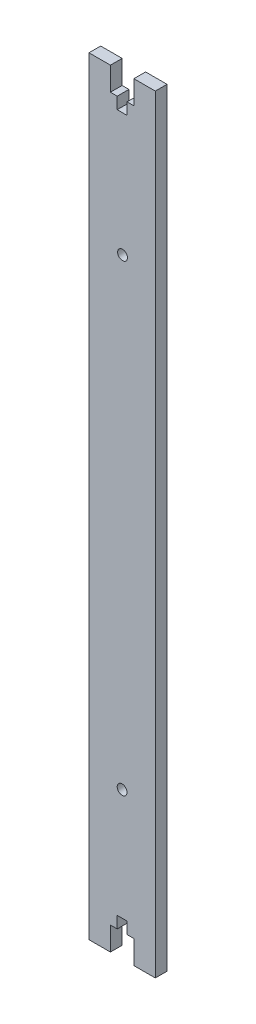
ISO-10303-21;
HEADER;
FILE_DESCRIPTION(('STEP AP214'),'2;1');
FILE_NAME('part.step','',(''),(''),'','','');
FILE_SCHEMA(('AUTOMOTIVE_DESIGN { 1 0 10303 214 1 1 1 1 }'));
ENDSEC;
DATA;
#1=APPLICATION_CONTEXT('core data for automotive mechanical design processes');
#2=APPLICATION_PROTOCOL_DEFINITION('international standard','automotive_design',2000,#1);
#3=PRODUCT_CONTEXT('',#1,'mechanical');
#4=PRODUCT('Part','Part','',(#3));
#5=PRODUCT_RELATED_PRODUCT_CATEGORY('part','',(#4));
#6=PRODUCT_DEFINITION_FORMATION('','',#4);
#7=PRODUCT_DEFINITION_CONTEXT('part definition',#1,'design');
#8=PRODUCT_DEFINITION('design','',#6,#7);
#9=PRODUCT_DEFINITION_SHAPE('','',#8);
#10=(LENGTH_UNIT() NAMED_UNIT(*) SI_UNIT(.MILLI.,.METRE.));
#11=(NAMED_UNIT(*) PLANE_ANGLE_UNIT() SI_UNIT($,.RADIAN.));
#12=(NAMED_UNIT(*) SI_UNIT($,.STERADIAN.) SOLID_ANGLE_UNIT());
#13=UNCERTAINTY_MEASURE_WITH_UNIT(LENGTH_MEASURE(1.E-05),#10,'distance_accuracy_value','');
#14=(GEOMETRIC_REPRESENTATION_CONTEXT(3) GLOBAL_UNCERTAINTY_ASSIGNED_CONTEXT((#13)) GLOBAL_UNIT_ASSIGNED_CONTEXT((#10,
#11,#12)) REPRESENTATION_CONTEXT('',''));
#15=CARTESIAN_POINT('',(0.,0.,0.));
#16=DIRECTION('',(0.,0.,1.));
#17=DIRECTION('',(1.,0.,0.));
#18=AXIS2_PLACEMENT_3D('',#15,#16,#17);
#19=CARTESIAN_POINT('',(-14.14,163.75,5.));
#20=DIRECTION('',(0.,-1.,0.));
#21=DIRECTION('',(0.,0.,-1.));
#22=AXIS2_PLACEMENT_3D('',#19,#20,#21);
#23=PLANE('',#22);
#24=DIRECTION('',(-1.,0.,0.));
#25=VECTOR('',#24,1.);
#26=CARTESIAN_POINT('',(-14.14,163.75,0.));
#27=LINE('',#26,#25);
#28=CARTESIAN_POINT('',(14.14,163.75,0.));
#29=VERTEX_POINT('',#28);
#30=CARTESIAN_POINT('',(5.,163.75,0.));
#31=VERTEX_POINT('',#30);
#32=EDGE_CURVE('E217',#29,#31,#27,.T.);
#33=ORIENTED_EDGE('',*,*,#32,.T.);
#34=DIRECTION('',(0.,0.,1.));
#35=VECTOR('',#34,1.);
#36=CARTESIAN_POINT('',(5.,163.75,-5.));
#37=LINE('',#36,#35);
#38=CARTESIAN_POINT('',(5.,163.75,5.));
#39=VERTEX_POINT('',#38);
#40=EDGE_CURVE('E237',#31,#39,#37,.T.);
#41=ORIENTED_EDGE('',*,*,#40,.T.);
#42=DIRECTION('',(-1.,0.,0.));
#43=VECTOR('',#42,1.);
#44=CARTESIAN_POINT('',(-14.14,163.75,5.));
#45=LINE('',#44,#43);
#46=CARTESIAN_POINT('',(14.14,163.75,5.));
#47=VERTEX_POINT('',#46);
#48=EDGE_CURVE('E196',#47,#39,#45,.T.);
#49=ORIENTED_EDGE('',*,*,#48,.F.);
#50=DIRECTION('',(0.,0.,-1.));
#51=VECTOR('',#50,1.);
#52=CARTESIAN_POINT('',(14.14,163.75,5.));
#53=LINE('',#52,#51);
#54=EDGE_CURVE('E231',#47,#29,#53,.T.);
#55=ORIENTED_EDGE('',*,*,#54,.T.);
#56=EDGE_LOOP('',(#33,#41,#49,#55));
#57=FACE_BOUND('',#56,.T.);
#58=ADVANCED_FACE('F33',(#57),#23,.F.);
#59=CARTESIAN_POINT('',(-14.14,-163.75,5.));
#60=DIRECTION('',(0.,1.,0.));
#61=DIRECTION('',(0.,0.,1.));
#62=AXIS2_PLACEMENT_3D('',#59,#60,#61);
#63=PLANE('',#62);
#64=DIRECTION('',(1.,0.,0.));
#65=VECTOR('',#64,1.);
#66=CARTESIAN_POINT('',(-14.14,-163.75,0.));
#67=LINE('',#66,#65);
#68=CARTESIAN_POINT('',(-14.14,-163.75,0.));
#69=VERTEX_POINT('',#68);
#70=CARTESIAN_POINT('',(-4.99999999999996,-163.75,0.));
#71=VERTEX_POINT('',#70);
#72=EDGE_CURVE('E202',#69,#71,#67,.T.);
#73=ORIENTED_EDGE('',*,*,#72,.T.);
#74=DIRECTION('',(0.,0.,1.));
#75=VECTOR('',#74,1.);
#76=CARTESIAN_POINT('',(-4.99999999999996,-163.75,-5.));
#77=LINE('',#76,#75);
#78=CARTESIAN_POINT('',(-4.99999999999996,-163.75,5.));
#79=VERTEX_POINT('',#78);
#80=EDGE_CURVE('E190',#71,#79,#77,.T.);
#81=ORIENTED_EDGE('',*,*,#80,.T.);
#82=DIRECTION('',(1.,0.,0.));
#83=VECTOR('',#82,1.);
#84=CARTESIAN_POINT('',(-14.14,-163.75,5.));
#85=LINE('',#84,#83);
#86=CARTESIAN_POINT('',(-14.14,-163.75,5.));
#87=VERTEX_POINT('',#86);
#88=EDGE_CURVE('E208',#87,#79,#85,.T.);
#89=ORIENTED_EDGE('',*,*,#88,.F.);
#90=DIRECTION('',(0.,0.,-1.));
#91=VECTOR('',#90,1.);
#92=CARTESIAN_POINT('',(-14.14,-163.75,5.));
#93=LINE('',#92,#91);
#94=EDGE_CURVE('E227',#87,#69,#93,.T.);
#95=ORIENTED_EDGE('',*,*,#94,.T.);
#96=EDGE_LOOP('',(#73,#81,#89,#95));
#97=FACE_BOUND('',#96,.T.);
#98=ADVANCED_FACE('F396',(#97),#63,.F.);
#99=CARTESIAN_POINT('',(14.14,163.75,5.));
#100=DIRECTION('',(-1.,0.,0.));
#101=DIRECTION('',(0.,-1.,0.));
#102=AXIS2_PLACEMENT_3D('',#99,#100,#101);
#103=PLANE('',#102);
#104=DIRECTION('',(0.,1.,0.));
#105=VECTOR('',#104,1.);
#106=CARTESIAN_POINT('',(14.14,163.75,0.));
#107=LINE('',#106,#105);
#108=CARTESIAN_POINT('',(14.14,-163.75,0.));
#109=VERTEX_POINT('',#108);
#110=EDGE_CURVE('E212',#109,#29,#107,.T.);
#111=ORIENTED_EDGE('',*,*,#110,.T.);
#112=ORIENTED_EDGE('',*,*,#54,.F.);
#113=DIRECTION('',(0.,1.,0.));
#114=VECTOR('',#113,1.);
#115=CARTESIAN_POINT('',(14.14,163.75,5.));
#116=LINE('',#115,#114);
#117=CARTESIAN_POINT('',(14.14,-163.75,5.));
#118=VERTEX_POINT('',#117);
#119=EDGE_CURVE('E197',#118,#47,#116,.T.);
#120=ORIENTED_EDGE('',*,*,#119,.F.);
#121=DIRECTION('',(0.,0.,-1.));
#122=VECTOR('',#121,1.);
#123=CARTESIAN_POINT('',(14.14,-163.75,5.));
#124=LINE('',#123,#122);
#125=EDGE_CURVE('E211',#118,#109,#124,.T.);
#126=ORIENTED_EDGE('',*,*,#125,.T.);
#127=EDGE_LOOP('',(#111,#112,#120,#126));
#128=FACE_BOUND('',#127,.T.);
#129=ADVANCED_FACE('F35',(#128),#103,.F.);
#130=CARTESIAN_POINT('',(-5.,163.75,5.));
#131=VERTEX_POINT('',#130);
#132=CARTESIAN_POINT('',(-14.14,163.75,5.));
#133=VERTEX_POINT('',#132);
#134=EDGE_CURVE('E185',#131,#133,#45,.T.);
#135=ORIENTED_EDGE('',*,*,#134,.F.);
#136=DIRECTION('',(0.,0.,1.));
#137=VECTOR('',#136,1.);
#138=CARTESIAN_POINT('',(-5.,163.75,-5.));
#139=LINE('',#138,#137);
#140=CARTESIAN_POINT('',(-5.,163.75,0.));
#141=VERTEX_POINT('',#140);
#142=EDGE_CURVE('E169',#141,#131,#139,.T.);
#143=ORIENTED_EDGE('',*,*,#142,.F.);
#144=CARTESIAN_POINT('',(-14.14,163.75,0.));
#145=VERTEX_POINT('',#144);
#146=EDGE_CURVE('E215',#141,#145,#27,.T.);
#147=ORIENTED_EDGE('',*,*,#146,.T.);
#148=DIRECTION('',(0.,0.,-1.));
#149=VECTOR('',#148,1.);
#150=CARTESIAN_POINT('',(-14.14,163.75,5.));
#151=LINE('',#150,#149);
#152=EDGE_CURVE('E194',#133,#145,#151,.T.);
#153=ORIENTED_EDGE('',*,*,#152,.F.);
#154=EDGE_LOOP('',(#135,#143,#147,#153));
#155=FACE_BOUND('',#154,.T.);
#156=ADVANCED_FACE('F192',(#155),#23,.F.);
#157=CARTESIAN_POINT('',(-14.14,163.75,5.));
#158=DIRECTION('',(1.,0.,0.));
#159=DIRECTION('',(0.,1.,0.));
#160=AXIS2_PLACEMENT_3D('',#157,#158,#159);
#161=PLANE('',#160);
#162=DIRECTION('',(0.,-1.,0.));
#163=VECTOR('',#162,1.);
#164=CARTESIAN_POINT('',(-14.14,163.75,0.));
#165=LINE('',#164,#163);
#166=EDGE_CURVE('E220',#145,#69,#165,.T.);
#167=ORIENTED_EDGE('',*,*,#166,.T.);
#168=ORIENTED_EDGE('',*,*,#94,.F.);
#169=DIRECTION('',(0.,-1.,0.));
#170=VECTOR('',#169,1.);
#171=CARTESIAN_POINT('',(-14.14,163.75,5.));
#172=LINE('',#171,#170);
#173=EDGE_CURVE('E200',#133,#87,#172,.T.);
#174=ORIENTED_EDGE('',*,*,#173,.F.);
#175=ORIENTED_EDGE('',*,*,#152,.T.);
#176=EDGE_LOOP('',(#167,#168,#174,#175));
#177=FACE_BOUND('',#176,.T.);
#178=ADVANCED_FACE('F399',(#177),#161,.F.);
#179=CARTESIAN_POINT('',(5.00000000000004,-163.75,5.));
#180=VERTEX_POINT('',#179);
#181=EDGE_CURVE('E207',#180,#118,#85,.T.);
#182=ORIENTED_EDGE('',*,*,#181,.F.);
#183=DIRECTION('',(0.,0.,1.));
#184=VECTOR('',#183,1.);
#185=CARTESIAN_POINT('',(5.00000000000004,-163.75,-5.));
#186=LINE('',#185,#184);
#187=CARTESIAN_POINT('',(5.00000000000004,-163.75,0.));
#188=VERTEX_POINT('',#187);
#189=EDGE_CURVE('E319',#188,#180,#186,.T.);
#190=ORIENTED_EDGE('',*,*,#189,.F.);
#191=EDGE_CURVE('E222',#188,#109,#67,.T.);
#192=ORIENTED_EDGE('',*,*,#191,.T.);
#193=ORIENTED_EDGE('',*,*,#125,.F.);
#194=EDGE_LOOP('',(#182,#190,#192,#193));
#195=FACE_BOUND('',#194,.T.);
#196=ADVANCED_FACE('F368',(#195),#63,.F.);
#197=CARTESIAN_POINT('',(0.,0.,5.));
#198=DIRECTION('',(0.,0.,1.));
#199=DIRECTION('',(1.,0.,0.));
#200=AXIS2_PLACEMENT_3D('',#197,#198,#199);
#201=PLANE('',#200);
#202=CARTESIAN_POINT('',(-0.0021356237309457,-101.25,5.));
#203=DIRECTION('',(0.,0.,1.));
#204=DIRECTION('',(1.,0.,0.));
#205=AXIS2_PLACEMENT_3D('',#202,#203,#204);
#206=CIRCLE('',#205,2.1);
#207=CARTESIAN_POINT('',(2.09786437626906,-101.25,5.));
#208=VERTEX_POINT('',#207);
#209=EDGE_CURVE('E337',#208,#208,#206,.T.);
#210=ORIENTED_EDGE('',*,*,#209,.F.);
#211=EDGE_LOOP('',(#210));
#212=FACE_BOUND('',#211,.T.);
#213=DIRECTION('',(0.,1.,0.));
#214=VECTOR('',#213,1.);
#215=CARTESIAN_POINT('',(5.,163.75,5.));
#216=LINE('',#215,#214);
#217=CARTESIAN_POINT('',(5.,153.75,5.));
#218=VERTEX_POINT('',#217);
#219=EDGE_CURVE('E179',#218,#39,#216,.T.);
#220=ORIENTED_EDGE('',*,*,#219,.F.);
#221=DIRECTION('',(1.,0.,0.));
#222=VECTOR('',#221,1.);
#223=CARTESIAN_POINT('',(5.,153.75,5.));
#224=LINE('',#223,#222);
#225=CARTESIAN_POINT('',(2.1,153.75,5.));
#226=VERTEX_POINT('',#225);
#227=EDGE_CURVE('E353',#226,#218,#224,.T.);
#228=ORIENTED_EDGE('',*,*,#227,.F.);
#229=DIRECTION('',(0.,1.,0.));
#230=VECTOR('',#229,1.);
#231=CARTESIAN_POINT('',(2.1,153.75,5.));
#232=LINE('',#231,#230);
#233=CARTESIAN_POINT('',(2.1,148.75,5.));
#234=VERTEX_POINT('',#233);
#235=EDGE_CURVE('E286',#234,#226,#232,.T.);
#236=ORIENTED_EDGE('',*,*,#235,.F.);
#237=DIRECTION('',(1.,0.,0.));
#238=VECTOR('',#237,1.);
#239=CARTESIAN_POINT('',(2.1,148.75,5.));
#240=LINE('',#239,#238);
#241=CARTESIAN_POINT('',(-2.1,148.75,5.));
#242=VERTEX_POINT('',#241);
#243=EDGE_CURVE('E349',#242,#234,#240,.T.);
#244=ORIENTED_EDGE('',*,*,#243,.F.);
#245=DIRECTION('',(0.,-1.,0.));
#246=VECTOR('',#245,1.);
#247=CARTESIAN_POINT('',(-2.1,153.75,5.));
#248=LINE('',#247,#246);
#249=CARTESIAN_POINT('',(-2.1,153.75,5.));
#250=VERTEX_POINT('',#249);
#251=EDGE_CURVE('E346',#250,#242,#248,.T.);
#252=ORIENTED_EDGE('',*,*,#251,.F.);
#253=DIRECTION('',(1.,0.,0.));
#254=VECTOR('',#253,1.);
#255=CARTESIAN_POINT('',(-5.,153.75,5.));
#256=LINE('',#255,#254);
#257=CARTESIAN_POINT('',(-5.,153.75,5.));
#258=VERTEX_POINT('',#257);
#259=EDGE_CURVE('E189',#258,#250,#256,.T.);
#260=ORIENTED_EDGE('',*,*,#259,.F.);
#261=DIRECTION('',(0.,-1.,0.));
#262=VECTOR('',#261,1.);
#263=CARTESIAN_POINT('',(-5.,163.75,5.));
#264=LINE('',#263,#262);
#265=EDGE_CURVE('E172',#131,#258,#264,.T.);
#266=ORIENTED_EDGE('',*,*,#265,.F.);
#267=ORIENTED_EDGE('',*,*,#134,.T.);
#268=ORIENTED_EDGE('',*,*,#173,.T.);
#269=ORIENTED_EDGE('',*,*,#88,.T.);
#270=DIRECTION('',(0.,-1.,0.));
#271=VECTOR('',#270,1.);
#272=CARTESIAN_POINT('',(-4.99999999999996,-163.75,5.));
#273=LINE('',#272,#271);
#274=CARTESIAN_POINT('',(-4.99999999999996,-153.75,5.));
#275=VERTEX_POINT('',#274);
#276=EDGE_CURVE('E317',#275,#79,#273,.T.);
#277=ORIENTED_EDGE('',*,*,#276,.F.);
#278=DIRECTION('',(-1.,0.,0.));
#279=VECTOR('',#278,1.);
#280=CARTESIAN_POINT('',(-4.99999999999996,-153.75,5.));
#281=LINE('',#280,#279);
#282=CARTESIAN_POINT('',(-2.09999999999996,-153.75,5.));
#283=VERTEX_POINT('',#282);
#284=EDGE_CURVE('E314',#283,#275,#281,.T.);
#285=ORIENTED_EDGE('',*,*,#284,.F.);
#286=DIRECTION('',(0.,-1.,0.));
#287=VECTOR('',#286,1.);
#288=CARTESIAN_POINT('',(-2.09999999999996,-153.75,5.));
#289=LINE('',#288,#287);
#290=CARTESIAN_POINT('',(-2.09999999999996,-148.75,5.));
#291=VERTEX_POINT('',#290);
#292=EDGE_CURVE('E311',#291,#283,#289,.T.);
#293=ORIENTED_EDGE('',*,*,#292,.F.);
#294=DIRECTION('',(-1.,0.,0.));
#295=VECTOR('',#294,1.);
#296=CARTESIAN_POINT('',(2.10000000000004,-148.75,5.));
#297=LINE('',#296,#295);
#298=CARTESIAN_POINT('',(2.10000000000004,-148.75,5.));
#299=VERTEX_POINT('',#298);
#300=EDGE_CURVE('E308',#299,#291,#297,.T.);
#301=ORIENTED_EDGE('',*,*,#300,.F.);
#302=DIRECTION('',(0.,1.,0.));
#303=VECTOR('',#302,1.);
#304=CARTESIAN_POINT('',(2.10000000000004,-153.75,5.));
#305=LINE('',#304,#303);
#306=CARTESIAN_POINT('',(2.10000000000004,-153.75,5.));
#307=VERTEX_POINT('',#306);
#308=EDGE_CURVE('E305',#307,#299,#305,.T.);
#309=ORIENTED_EDGE('',*,*,#308,.F.);
#310=DIRECTION('',(-1.,0.,0.));
#311=VECTOR('',#310,1.);
#312=CARTESIAN_POINT('',(5.00000000000004,-153.75,5.));
#313=LINE('',#312,#311);
#314=CARTESIAN_POINT('',(5.00000000000004,-153.75,5.));
#315=VERTEX_POINT('',#314);
#316=EDGE_CURVE('E301',#315,#307,#313,.T.);
#317=ORIENTED_EDGE('',*,*,#316,.F.);
#318=DIRECTION('',(0.,1.,0.));
#319=VECTOR('',#318,1.);
#320=CARTESIAN_POINT('',(5.00000000000004,-163.75,5.));
#321=LINE('',#320,#319);
#322=EDGE_CURVE('E299',#180,#315,#321,.T.);
#323=ORIENTED_EDGE('',*,*,#322,.F.);
#324=ORIENTED_EDGE('',*,*,#181,.T.);
#325=ORIENTED_EDGE('',*,*,#119,.T.);
#326=ORIENTED_EDGE('',*,*,#48,.T.);
#327=EDGE_LOOP('',(#220,#228,#236,#244,#252,#260,#266,#267,#268,#269,#277,#285,#293,#301,#309,
#317,#323,#324,#325,#326));
#328=FACE_BOUND('',#327,.T.);
#329=CARTESIAN_POINT('',(0.163980899785712,96.2499999999999,5.));
#330=DIRECTION('',(0.,0.,1.));
#331=DIRECTION('',(1.,0.,0.));
#332=AXIS2_PLACEMENT_3D('',#329,#330,#331);
#333=CIRCLE('',#332,2.1);
#334=CARTESIAN_POINT('',(2.26398089978572,96.2499999999999,5.));
#335=VERTEX_POINT('',#334);
#336=EDGE_CURVE('E302',#335,#335,#333,.T.);
#337=ORIENTED_EDGE('',*,*,#336,.F.);
#338=EDGE_LOOP('',(#337));
#339=FACE_BOUND('',#338,.T.);
#340=ADVANCED_FACE('F183',(#212,#328,#339),#201,.T.);
#341=CARTESIAN_POINT('',(0.,0.,0.));
#342=DIRECTION('',(0.,0.,1.));
#343=DIRECTION('',(1.,0.,0.));
#344=AXIS2_PLACEMENT_3D('',#341,#342,#343);
#345=PLANE('',#344);
#346=CARTESIAN_POINT('',(-0.0021356237309457,-101.25,0.));
#347=DIRECTION('',(0.,0.,1.));
#348=DIRECTION('',(1.,0.,0.));
#349=AXIS2_PLACEMENT_3D('',#346,#347,#348);
#350=CIRCLE('',#349,2.1);
#351=CARTESIAN_POINT('',(2.09786437626906,-101.25,0.));
#352=VERTEX_POINT('',#351);
#353=EDGE_CURVE('E37',#352,#352,#350,.T.);
#354=ORIENTED_EDGE('',*,*,#353,.T.);
#355=EDGE_LOOP('',(#354));
#356=FACE_BOUND('',#355,.T.);
#357=CARTESIAN_POINT('',(0.163980899785712,96.2499999999999,0.));
#358=DIRECTION('',(0.,0.,1.));
#359=DIRECTION('',(1.,0.,0.));
#360=AXIS2_PLACEMENT_3D('',#357,#358,#359);
#361=CIRCLE('',#360,2.1);
#362=CARTESIAN_POINT('',(2.26398089978572,96.2499999999999,0.));
#363=VERTEX_POINT('',#362);
#364=EDGE_CURVE('E216',#363,#363,#361,.T.);
#365=ORIENTED_EDGE('',*,*,#364,.T.);
#366=EDGE_LOOP('',(#365));
#367=FACE_BOUND('',#366,.T.);
#368=DIRECTION('',(1.,0.,0.));
#369=VECTOR('',#368,1.);
#370=CARTESIAN_POINT('',(0.,153.75,0.));
#371=LINE('',#370,#369);
#372=CARTESIAN_POINT('',(2.1,153.75,0.));
#373=VERTEX_POINT('',#372);
#374=CARTESIAN_POINT('',(5.,153.75,0.));
#375=VERTEX_POINT('',#374);
#376=EDGE_CURVE('E42',#373,#375,#371,.T.);
#377=ORIENTED_EDGE('',*,*,#376,.T.);
#378=DIRECTION('',(0.,1.,0.));
#379=VECTOR('',#378,1.);
#380=CARTESIAN_POINT('',(5.00000000000003,0.,0.));
#381=LINE('',#380,#379);
#382=EDGE_CURVE('E11',#375,#31,#381,.T.);
#383=ORIENTED_EDGE('',*,*,#382,.T.);
#384=ORIENTED_EDGE('',*,*,#32,.F.);
#385=ORIENTED_EDGE('',*,*,#110,.F.);
#386=ORIENTED_EDGE('',*,*,#191,.F.);
#387=DIRECTION('',(0.,1.,0.));
#388=VECTOR('',#387,1.);
#389=CARTESIAN_POINT('',(5.,0.,0.));
#390=LINE('',#389,#388);
#391=CARTESIAN_POINT('',(5.00000000000004,-153.75,0.));
#392=VERTEX_POINT('',#391);
#393=EDGE_CURVE('E234',#188,#392,#390,.T.);
#394=ORIENTED_EDGE('',*,*,#393,.T.);
#395=DIRECTION('',(-1.,0.,0.));
#396=VECTOR('',#395,1.);
#397=CARTESIAN_POINT('',(0.,-153.75,0.));
#398=LINE('',#397,#396);
#399=CARTESIAN_POINT('',(2.10000000000004,-153.75,0.));
#400=VERTEX_POINT('',#399);
#401=EDGE_CURVE('E240',#392,#400,#398,.T.);
#402=ORIENTED_EDGE('',*,*,#401,.T.);
#403=DIRECTION('',(0.,1.,0.));
#404=VECTOR('',#403,1.);
#405=CARTESIAN_POINT('',(2.10000000000004,0.,0.));
#406=LINE('',#405,#404);
#407=CARTESIAN_POINT('',(2.10000000000004,-148.75,0.));
#408=VERTEX_POINT('',#407);
#409=EDGE_CURVE('E243',#400,#408,#406,.T.);
#410=ORIENTED_EDGE('',*,*,#409,.T.);
#411=DIRECTION('',(-1.,0.,0.));
#412=VECTOR('',#411,1.);
#413=CARTESIAN_POINT('',(0.,-148.75,0.));
#414=LINE('',#413,#412);
#415=CARTESIAN_POINT('',(-2.09999999999996,-148.75,0.));
#416=VERTEX_POINT('',#415);
#417=EDGE_CURVE('E246',#408,#416,#414,.T.);
#418=ORIENTED_EDGE('',*,*,#417,.T.);
#419=DIRECTION('',(0.,-1.,0.));
#420=VECTOR('',#419,1.);
#421=CARTESIAN_POINT('',(-2.09999999999999,0.,0.));
#422=LINE('',#421,#420);
#423=CARTESIAN_POINT('',(-2.09999999999996,-153.75,0.));
#424=VERTEX_POINT('',#423);
#425=EDGE_CURVE('E249',#416,#424,#422,.T.);
#426=ORIENTED_EDGE('',*,*,#425,.T.);
#427=DIRECTION('',(-1.,0.,0.));
#428=VECTOR('',#427,1.);
#429=CARTESIAN_POINT('',(0.,-153.75,0.));
#430=LINE('',#429,#428);
#431=CARTESIAN_POINT('',(-4.99999999999996,-153.75,0.));
#432=VERTEX_POINT('',#431);
#433=EDGE_CURVE('E252',#424,#432,#430,.T.);
#434=ORIENTED_EDGE('',*,*,#433,.T.);
#435=DIRECTION('',(0.,-1.,0.));
#436=VECTOR('',#435,1.);
#437=CARTESIAN_POINT('',(-4.99999999999997,0.,0.));
#438=LINE('',#437,#436);
#439=EDGE_CURVE('E255',#432,#71,#438,.T.);
#440=ORIENTED_EDGE('',*,*,#439,.T.);
#441=ORIENTED_EDGE('',*,*,#72,.F.);
#442=ORIENTED_EDGE('',*,*,#166,.F.);
#443=ORIENTED_EDGE('',*,*,#146,.F.);
#444=DIRECTION('',(0.,-1.,0.));
#445=VECTOR('',#444,1.);
#446=CARTESIAN_POINT('',(-4.99999999999997,0.,0.));
#447=LINE('',#446,#445);
#448=CARTESIAN_POINT('',(-5.,153.75,0.));
#449=VERTEX_POINT('',#448);
#450=EDGE_CURVE('E175',#141,#449,#447,.T.);
#451=ORIENTED_EDGE('',*,*,#450,.T.);
#452=DIRECTION('',(1.,0.,0.));
#453=VECTOR('',#452,1.);
#454=CARTESIAN_POINT('',(0.,153.75,0.));
#455=LINE('',#454,#453);
#456=CARTESIAN_POINT('',(-2.1,153.75,0.));
#457=VERTEX_POINT('',#456);
#458=EDGE_CURVE('E259',#449,#457,#455,.T.);
#459=ORIENTED_EDGE('',*,*,#458,.T.);
#460=DIRECTION('',(0.,-1.,0.));
#461=VECTOR('',#460,1.);
#462=CARTESIAN_POINT('',(-2.09999999999998,0.,0.));
#463=LINE('',#462,#461);
#464=CARTESIAN_POINT('',(-2.1,148.75,0.));
#465=VERTEX_POINT('',#464);
#466=EDGE_CURVE('E262',#457,#465,#463,.T.);
#467=ORIENTED_EDGE('',*,*,#466,.T.);
#468=DIRECTION('',(1.,0.,0.));
#469=VECTOR('',#468,1.);
#470=CARTESIAN_POINT('',(0.,148.75,0.));
#471=LINE('',#470,#469);
#472=CARTESIAN_POINT('',(2.1,148.75,0.));
#473=VERTEX_POINT('',#472);
#474=EDGE_CURVE('E265',#465,#473,#471,.T.);
#475=ORIENTED_EDGE('',*,*,#474,.T.);
#476=DIRECTION('',(0.,1.,0.));
#477=VECTOR('',#476,1.);
#478=CARTESIAN_POINT('',(2.10000000000002,0.,0.));
#479=LINE('',#478,#477);
#480=EDGE_CURVE('E268',#473,#373,#479,.T.);
#481=ORIENTED_EDGE('',*,*,#480,.T.);
#482=EDGE_LOOP('',(#377,#383,#384,#385,#386,#394,#402,#410,#418,#426,#434,#440,#441,#442,#443,
#451,#459,#467,#475,#481));
#483=FACE_BOUND('',#482,.T.);
#484=ADVANCED_FACE('F273',(#356,#367,#483),#345,.F.);
#485=CARTESIAN_POINT('',(0.163980899785712,96.2499999999999,-5.));
#486=DIRECTION('',(0.,0.,1.));
#487=DIRECTION('',(1.,0.,0.));
#488=AXIS2_PLACEMENT_3D('',#485,#486,#487);
#489=CYLINDRICAL_SURFACE('',#488,2.1);
#490=ORIENTED_EDGE('',*,*,#336,.T.);
#491=EDGE_LOOP('',(#490));
#492=FACE_BOUND('',#491,.T.);
#493=ORIENTED_EDGE('',*,*,#364,.F.);
#494=EDGE_LOOP('',(#493));
#495=FACE_BOUND('',#494,.T.);
#496=ADVANCED_FACE('F458',(#492,#495),#489,.F.);
#497=CARTESIAN_POINT('',(-4.99999999999996,-163.75,-5.));
#498=DIRECTION('',(-1.,0.,0.));
#499=DIRECTION('',(0.,-1.,0.));
#500=AXIS2_PLACEMENT_3D('',#497,#498,#499);
#501=PLANE('',#500);
#502=DIRECTION('',(0.,0.,1.));
#503=VECTOR('',#502,1.);
#504=CARTESIAN_POINT('',(-4.99999999999996,-153.75,-5.));
#505=LINE('',#504,#503);
#506=EDGE_CURVE('E322',#432,#275,#505,.T.);
#507=ORIENTED_EDGE('',*,*,#506,.T.);
#508=ORIENTED_EDGE('',*,*,#276,.T.);
#509=ORIENTED_EDGE('',*,*,#80,.F.);
#510=ORIENTED_EDGE('',*,*,#439,.F.);
#511=EDGE_LOOP('',(#507,#508,#509,#510));
#512=FACE_BOUND('',#511,.T.);
#513=ADVANCED_FACE('F393',(#512),#501,.F.);
#514=CARTESIAN_POINT('',(-4.99999999999996,-153.75,-5.));
#515=DIRECTION('',(0.,1.,0.));
#516=DIRECTION('',(0.,0.,1.));
#517=AXIS2_PLACEMENT_3D('',#514,#515,#516);
#518=PLANE('',#517);
#519=DIRECTION('',(0.,0.,1.));
#520=VECTOR('',#519,1.);
#521=CARTESIAN_POINT('',(-2.09999999999996,-153.75,-5.));
#522=LINE('',#521,#520);
#523=EDGE_CURVE('E324',#424,#283,#522,.T.);
#524=ORIENTED_EDGE('',*,*,#523,.T.);
#525=ORIENTED_EDGE('',*,*,#284,.T.);
#526=ORIENTED_EDGE('',*,*,#506,.F.);
#527=ORIENTED_EDGE('',*,*,#433,.F.);
#528=EDGE_LOOP('',(#524,#525,#526,#527));
#529=FACE_BOUND('',#528,.T.);
#530=ADVANCED_FACE('F390',(#529),#518,.F.);
#531=CARTESIAN_POINT('',(-2.09999999999996,-153.75,-5.));
#532=DIRECTION('',(-1.,0.,0.));
#533=DIRECTION('',(0.,-1.,0.));
#534=AXIS2_PLACEMENT_3D('',#531,#532,#533);
#535=PLANE('',#534);
#536=DIRECTION('',(0.,0.,1.));
#537=VECTOR('',#536,1.);
#538=CARTESIAN_POINT('',(-2.09999999999996,-148.75,-5.));
#539=LINE('',#538,#537);
#540=EDGE_CURVE('E326',#416,#291,#539,.T.);
#541=ORIENTED_EDGE('',*,*,#540,.T.);
#542=ORIENTED_EDGE('',*,*,#292,.T.);
#543=ORIENTED_EDGE('',*,*,#523,.F.);
#544=ORIENTED_EDGE('',*,*,#425,.F.);
#545=EDGE_LOOP('',(#541,#542,#543,#544));
#546=FACE_BOUND('',#545,.T.);
#547=ADVANCED_FACE('F384',(#546),#535,.F.);
#548=CARTESIAN_POINT('',(2.10000000000004,-148.75,-5.));
#549=DIRECTION('',(0.,1.,0.));
#550=DIRECTION('',(0.,0.,1.));
#551=AXIS2_PLACEMENT_3D('',#548,#549,#550);
#552=PLANE('',#551);
#553=DIRECTION('',(0.,0.,1.));
#554=VECTOR('',#553,1.);
#555=CARTESIAN_POINT('',(2.10000000000004,-148.75,-5.));
#556=LINE('',#555,#554);
#557=EDGE_CURVE('E328',#408,#299,#556,.T.);
#558=ORIENTED_EDGE('',*,*,#557,.T.);
#559=ORIENTED_EDGE('',*,*,#300,.T.);
#560=ORIENTED_EDGE('',*,*,#540,.F.);
#561=ORIENTED_EDGE('',*,*,#417,.F.);
#562=EDGE_LOOP('',(#558,#559,#560,#561));
#563=FACE_BOUND('',#562,.T.);
#564=ADVANCED_FACE('F380',(#563),#552,.F.);
#565=CARTESIAN_POINT('',(2.10000000000004,-153.75,-5.));
#566=DIRECTION('',(1.,0.,0.));
#567=DIRECTION('',(0.,0.,-1.));
#568=AXIS2_PLACEMENT_3D('',#565,#566,#567);
#569=PLANE('',#568);
#570=DIRECTION('',(0.,0.,1.));
#571=VECTOR('',#570,1.);
#572=CARTESIAN_POINT('',(2.10000000000004,-153.75,-5.));
#573=LINE('',#572,#571);
#574=EDGE_CURVE('E330',#400,#307,#573,.T.);
#575=ORIENTED_EDGE('',*,*,#574,.T.);
#576=ORIENTED_EDGE('',*,*,#308,.T.);
#577=ORIENTED_EDGE('',*,*,#557,.F.);
#578=ORIENTED_EDGE('',*,*,#409,.F.);
#579=EDGE_LOOP('',(#575,#576,#577,#578));
#580=FACE_BOUND('',#579,.T.);
#581=ADVANCED_FACE('F378',(#580),#569,.F.);
#582=CARTESIAN_POINT('',(5.00000000000004,-153.75,-5.));
#583=DIRECTION('',(0.,1.,0.));
#584=DIRECTION('',(0.,0.,1.));
#585=AXIS2_PLACEMENT_3D('',#582,#583,#584);
#586=PLANE('',#585);
#587=DIRECTION('',(0.,0.,1.));
#588=VECTOR('',#587,1.);
#589=CARTESIAN_POINT('',(5.00000000000004,-153.75,-5.));
#590=LINE('',#589,#588);
#591=EDGE_CURVE('E57',#392,#315,#590,.T.);
#592=ORIENTED_EDGE('',*,*,#591,.T.);
#593=ORIENTED_EDGE('',*,*,#316,.T.);
#594=ORIENTED_EDGE('',*,*,#574,.F.);
#595=ORIENTED_EDGE('',*,*,#401,.F.);
#596=EDGE_LOOP('',(#592,#593,#594,#595));
#597=FACE_BOUND('',#596,.T.);
#598=ADVANCED_FACE('F375',(#597),#586,.F.);
#599=CARTESIAN_POINT('',(5.00000000000004,-163.75,-5.));
#600=DIRECTION('',(1.,0.,0.));
#601=DIRECTION('',(0.,1.,0.));
#602=AXIS2_PLACEMENT_3D('',#599,#600,#601);
#603=PLANE('',#602);
#604=ORIENTED_EDGE('',*,*,#189,.T.);
#605=ORIENTED_EDGE('',*,*,#322,.T.);
#606=ORIENTED_EDGE('',*,*,#591,.F.);
#607=ORIENTED_EDGE('',*,*,#393,.F.);
#608=EDGE_LOOP('',(#604,#605,#606,#607));
#609=FACE_BOUND('',#608,.T.);
#610=ADVANCED_FACE('F369',(#609),#603,.F.);
#611=CARTESIAN_POINT('',(5.,163.75,-5.));
#612=DIRECTION('',(1.,0.,0.));
#613=DIRECTION('',(0.,1.,0.));
#614=AXIS2_PLACEMENT_3D('',#611,#612,#613);
#615=PLANE('',#614);
#616=DIRECTION('',(0.,0.,1.));
#617=VECTOR('',#616,1.);
#618=CARTESIAN_POINT('',(5.,153.75,-5.));
#619=LINE('',#618,#617);
#620=EDGE_CURVE('E281',#375,#218,#619,.T.);
#621=ORIENTED_EDGE('',*,*,#620,.T.);
#622=ORIENTED_EDGE('',*,*,#219,.T.);
#623=ORIENTED_EDGE('',*,*,#40,.F.);
#624=ORIENTED_EDGE('',*,*,#382,.F.);
#625=EDGE_LOOP('',(#621,#622,#623,#624));
#626=FACE_BOUND('',#625,.T.);
#627=ADVANCED_FACE('F520',(#626),#615,.F.);
#628=CARTESIAN_POINT('',(5.,153.75,-5.));
#629=DIRECTION('',(0.,-1.,0.));
#630=DIRECTION('',(0.,0.,-1.));
#631=AXIS2_PLACEMENT_3D('',#628,#629,#630);
#632=PLANE('',#631);
#633=DIRECTION('',(0.,0.,1.));
#634=VECTOR('',#633,1.);
#635=CARTESIAN_POINT('',(2.1,153.75,-5.));
#636=LINE('',#635,#634);
#637=EDGE_CURVE('E279',#373,#226,#636,.T.);
#638=ORIENTED_EDGE('',*,*,#637,.T.);
#639=ORIENTED_EDGE('',*,*,#227,.T.);
#640=ORIENTED_EDGE('',*,*,#620,.F.);
#641=ORIENTED_EDGE('',*,*,#376,.F.);
#642=EDGE_LOOP('',(#638,#639,#640,#641));
#643=FACE_BOUND('',#642,.T.);
#644=ADVANCED_FACE('F277',(#643),#632,.F.);
#645=CARTESIAN_POINT('',(2.1,153.75,-5.));
#646=DIRECTION('',(1.,0.,0.));
#647=DIRECTION('',(0.,1.,0.));
#648=AXIS2_PLACEMENT_3D('',#645,#646,#647);
#649=PLANE('',#648);
#650=DIRECTION('',(0.,0.,1.));
#651=VECTOR('',#650,1.);
#652=CARTESIAN_POINT('',(2.1,148.75,-5.));
#653=LINE('',#652,#651);
#654=EDGE_CURVE('E288',#473,#234,#653,.T.);
#655=ORIENTED_EDGE('',*,*,#654,.T.);
#656=ORIENTED_EDGE('',*,*,#235,.T.);
#657=ORIENTED_EDGE('',*,*,#637,.F.);
#658=ORIENTED_EDGE('',*,*,#480,.F.);
#659=EDGE_LOOP('',(#655,#656,#657,#658));
#660=FACE_BOUND('',#659,.T.);
#661=ADVANCED_FACE('F283',(#660),#649,.F.);
#662=CARTESIAN_POINT('',(2.1,148.75,-5.));
#663=DIRECTION('',(0.,-1.,0.));
#664=DIRECTION('',(0.,0.,-1.));
#665=AXIS2_PLACEMENT_3D('',#662,#663,#664);
#666=PLANE('',#665);
#667=DIRECTION('',(0.,0.,1.));
#668=VECTOR('',#667,1.);
#669=CARTESIAN_POINT('',(-2.1,148.75,-5.));
#670=LINE('',#669,#668);
#671=EDGE_CURVE('E291',#465,#242,#670,.T.);
#672=ORIENTED_EDGE('',*,*,#671,.T.);
#673=ORIENTED_EDGE('',*,*,#243,.T.);
#674=ORIENTED_EDGE('',*,*,#654,.F.);
#675=ORIENTED_EDGE('',*,*,#474,.F.);
#676=EDGE_LOOP('',(#672,#673,#674,#675));
#677=FACE_BOUND('',#676,.T.);
#678=ADVANCED_FACE('F409',(#677),#666,.F.);
#679=CARTESIAN_POINT('',(-2.1,153.75,-5.));
#680=DIRECTION('',(-1.,0.,0.));
#681=DIRECTION('',(0.,-1.,0.));
#682=AXIS2_PLACEMENT_3D('',#679,#680,#681);
#683=PLANE('',#682);
#684=DIRECTION('',(0.,0.,1.));
#685=VECTOR('',#684,1.);
#686=CARTESIAN_POINT('',(-2.1,153.75,-5.));
#687=LINE('',#686,#685);
#688=EDGE_CURVE('E296',#457,#250,#687,.T.);
#689=ORIENTED_EDGE('',*,*,#688,.T.);
#690=ORIENTED_EDGE('',*,*,#251,.T.);
#691=ORIENTED_EDGE('',*,*,#671,.F.);
#692=ORIENTED_EDGE('',*,*,#466,.F.);
#693=EDGE_LOOP('',(#689,#690,#691,#692));
#694=FACE_BOUND('',#693,.T.);
#695=ADVANCED_FACE('F405',(#694),#683,.F.);
#696=CARTESIAN_POINT('',(-5.,153.75,-5.));
#697=DIRECTION('',(0.,-1.,0.));
#698=DIRECTION('',(0.,0.,-1.));
#699=AXIS2_PLACEMENT_3D('',#696,#697,#698);
#700=PLANE('',#699);
#701=DIRECTION('',(0.,0.,1.));
#702=VECTOR('',#701,1.);
#703=CARTESIAN_POINT('',(-5.,153.75,-5.));
#704=LINE('',#703,#702);
#705=EDGE_CURVE('E49',#449,#258,#704,.T.);
#706=ORIENTED_EDGE('',*,*,#705,.T.);
#707=ORIENTED_EDGE('',*,*,#259,.T.);
#708=ORIENTED_EDGE('',*,*,#688,.F.);
#709=ORIENTED_EDGE('',*,*,#458,.F.);
#710=EDGE_LOOP('',(#706,#707,#708,#709));
#711=FACE_BOUND('',#710,.T.);
#712=ADVANCED_FACE('F403',(#711),#700,.F.);
#713=CARTESIAN_POINT('',(-5.,163.75,-5.));
#714=DIRECTION('',(-1.,0.,0.));
#715=DIRECTION('',(0.,-1.,0.));
#716=AXIS2_PLACEMENT_3D('',#713,#714,#715);
#717=PLANE('',#716);
#718=ORIENTED_EDGE('',*,*,#142,.T.);
#719=ORIENTED_EDGE('',*,*,#265,.T.);
#720=ORIENTED_EDGE('',*,*,#705,.F.);
#721=ORIENTED_EDGE('',*,*,#450,.F.);
#722=EDGE_LOOP('',(#718,#719,#720,#721));
#723=FACE_BOUND('',#722,.T.);
#724=ADVANCED_FACE('F171',(#723),#717,.F.);
#725=CARTESIAN_POINT('',(-0.0021356237309457,-101.25,-5.));
#726=DIRECTION('',(0.,0.,1.));
#727=DIRECTION('',(1.,0.,0.));
#728=AXIS2_PLACEMENT_3D('',#725,#726,#727);
#729=CYLINDRICAL_SURFACE('',#728,2.1);
#730=ORIENTED_EDGE('',*,*,#209,.T.);
#731=EDGE_LOOP('',(#730));
#732=FACE_BOUND('',#731,.T.);
#733=ORIENTED_EDGE('',*,*,#353,.F.);
#734=EDGE_LOOP('',(#733));
#735=FACE_BOUND('',#734,.T.);
#736=ADVANCED_FACE('F569',(#732,#735),#729,.F.);
#737=CLOSED_SHELL('',(#58,#98,#129,#156,#178,#196,#340,#484,#496,#513,#530,#547,#564,#581,#598,
#610,#627,#644,#661,#678,#695,#712,#724,#736));
#738=MANIFOLD_SOLID_BREP('B2',#737);
#739=ADVANCED_BREP_SHAPE_REPRESENTATION('',(#18,#738),#14);
#740=SHAPE_DEFINITION_REPRESENTATION(#9,#739);
ENDSEC;
END-ISO-10303-21;
